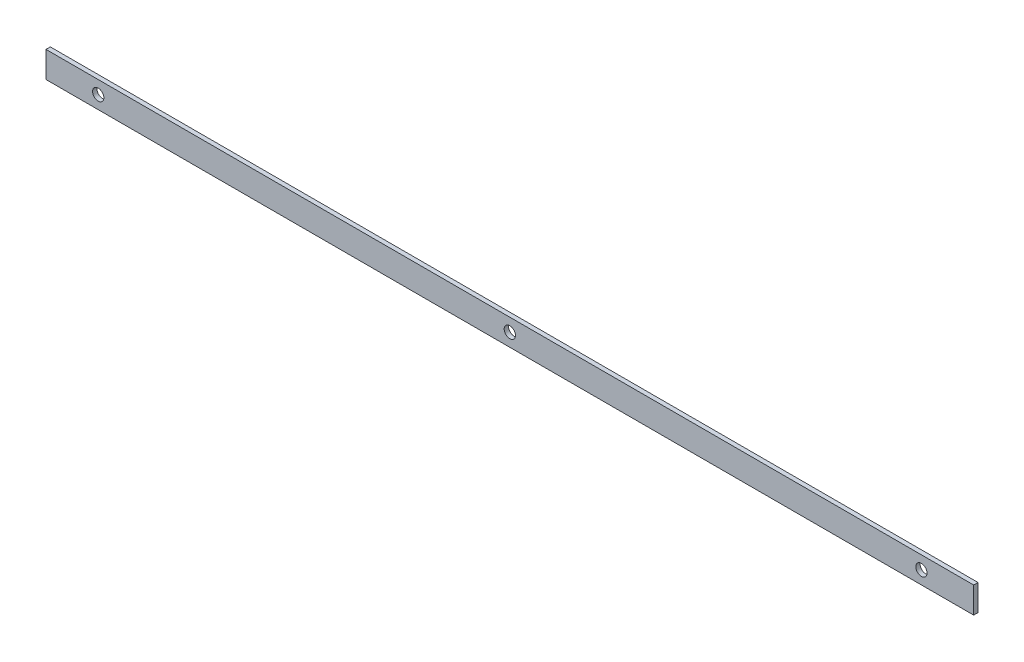
ISO-10303-21;
HEADER;
FILE_DESCRIPTION(('STEP AP214'),'2;1');
FILE_NAME('part.step','',(''),(''),'','','');
FILE_SCHEMA(('AUTOMOTIVE_DESIGN { 1 0 10303 214 1 1 1 1 }'));
ENDSEC;
DATA;
#1=APPLICATION_CONTEXT('core data for automotive mechanical design processes');
#2=APPLICATION_PROTOCOL_DEFINITION('international standard','automotive_design',2000,#1);
#3=PRODUCT_CONTEXT('',#1,'mechanical');
#4=PRODUCT('Part','Part','',(#3));
#5=PRODUCT_RELATED_PRODUCT_CATEGORY('part','',(#4));
#6=PRODUCT_DEFINITION_FORMATION('','',#4);
#7=PRODUCT_DEFINITION_CONTEXT('part definition',#1,'design');
#8=PRODUCT_DEFINITION('design','',#6,#7);
#9=PRODUCT_DEFINITION_SHAPE('','',#8);
#10=(LENGTH_UNIT() NAMED_UNIT(*) SI_UNIT(.MILLI.,.METRE.));
#11=(NAMED_UNIT(*) PLANE_ANGLE_UNIT() SI_UNIT($,.RADIAN.));
#12=(NAMED_UNIT(*) SI_UNIT($,.STERADIAN.) SOLID_ANGLE_UNIT());
#13=UNCERTAINTY_MEASURE_WITH_UNIT(LENGTH_MEASURE(1.E-05),#10,'distance_accuracy_value','');
#14=(GEOMETRIC_REPRESENTATION_CONTEXT(3) GLOBAL_UNCERTAINTY_ASSIGNED_CONTEXT((#13)) GLOBAL_UNIT_ASSIGNED_CONTEXT((#10,
#11,#12)) REPRESENTATION_CONTEXT('',''));
#15=CARTESIAN_POINT('',(0.,0.,0.));
#16=DIRECTION('',(0.,0.,1.));
#17=DIRECTION('',(1.,0.,0.));
#18=AXIS2_PLACEMENT_3D('',#15,#16,#17);
#19=CARTESIAN_POINT('',(473.,0.,-2.5));
#20=DIRECTION('',(0.,0.,-1.));
#21=DIRECTION('',(-1.,0.,0.));
#22=AXIS2_PLACEMENT_3D('',#19,#20,#21);
#23=CYLINDRICAL_SURFACE('',#22,6.50000000000001);
#24=CARTESIAN_POINT('',(473.,0.,2.5));
#25=DIRECTION('',(0.,0.,-1.));
#26=DIRECTION('',(-1.,0.,0.));
#27=AXIS2_PLACEMENT_3D('',#24,#25,#26);
#28=CIRCLE('',#27,6.50000000000001);
#29=CARTESIAN_POINT('',(466.5,0.,2.5));
#30=VERTEX_POINT('',#29);
#31=EDGE_CURVE('E57',#30,#30,#28,.T.);
#32=ORIENTED_EDGE('',*,*,#31,.F.);
#33=EDGE_LOOP('',(#32));
#34=FACE_BOUND('',#33,.T.);
#35=CARTESIAN_POINT('',(473.,0.,-2.5));
#36=DIRECTION('',(0.,0.,-1.));
#37=DIRECTION('',(-1.,0.,0.));
#38=AXIS2_PLACEMENT_3D('',#35,#36,#37);
#39=CIRCLE('',#38,6.50000000000001);
#40=CARTESIAN_POINT('',(466.5,0.,-2.5));
#41=VERTEX_POINT('',#40);
#42=EDGE_CURVE('E12',#41,#41,#39,.T.);
#43=ORIENTED_EDGE('',*,*,#42,.T.);
#44=EDGE_LOOP('',(#43));
#45=FACE_BOUND('',#44,.T.);
#46=ADVANCED_FACE('F49',(#34,#45),#23,.F.);
#47=CARTESIAN_POINT('',(533.,-15.,2.5));
#48=DIRECTION('',(0.,1.,0.));
#49=DIRECTION('',(0.,0.,1.));
#50=AXIS2_PLACEMENT_3D('',#47,#48,#49);
#51=PLANE('',#50);
#52=DIRECTION('',(0.,0.,-1.));
#53=VECTOR('',#52,1.);
#54=CARTESIAN_POINT('',(-533.,-15.,2.5));
#55=LINE('',#54,#53);
#56=CARTESIAN_POINT('',(-533.,-15.,2.5));
#57=VERTEX_POINT('',#56);
#58=CARTESIAN_POINT('',(-533.,-15.,-2.5));
#59=VERTEX_POINT('',#58);
#60=EDGE_CURVE('E117',#57,#59,#55,.T.);
#61=ORIENTED_EDGE('',*,*,#60,.T.);
#62=DIRECTION('',(-1.,0.,0.));
#63=VECTOR('',#62,1.);
#64=CARTESIAN_POINT('',(533.,-15.,-2.5));
#65=LINE('',#64,#63);
#66=CARTESIAN_POINT('',(533.,-15.,-2.5));
#67=VERTEX_POINT('',#66);
#68=EDGE_CURVE('E108',#67,#59,#65,.T.);
#69=ORIENTED_EDGE('',*,*,#68,.F.);
#70=DIRECTION('',(0.,0.,-1.));
#71=VECTOR('',#70,1.);
#72=CARTESIAN_POINT('',(533.,-15.,2.5));
#73=LINE('',#72,#71);
#74=CARTESIAN_POINT('',(533.,-15.,2.5));
#75=VERTEX_POINT('',#74);
#76=EDGE_CURVE('E101',#75,#67,#73,.T.);
#77=ORIENTED_EDGE('',*,*,#76,.F.);
#78=DIRECTION('',(-1.,0.,0.));
#79=VECTOR('',#78,1.);
#80=CARTESIAN_POINT('',(533.,-15.,2.5));
#81=LINE('',#80,#79);
#82=EDGE_CURVE('E113',#75,#57,#81,.T.);
#83=ORIENTED_EDGE('',*,*,#82,.T.);
#84=EDGE_LOOP('',(#61,#69,#77,#83));
#85=FACE_BOUND('',#84,.T.);
#86=ADVANCED_FACE('F133',(#85),#51,.F.);
#87=CARTESIAN_POINT('',(533.,-15.,-2.5));
#88=DIRECTION('',(0.,0.,1.));
#89=DIRECTION('',(1.,0.,0.));
#90=AXIS2_PLACEMENT_3D('',#87,#88,#89);
#91=PLANE('',#90);
#92=CARTESIAN_POINT('',(0.,0.,-2.5));
#93=DIRECTION('',(0.,0.,-1.));
#94=DIRECTION('',(-1.,0.,0.));
#95=AXIS2_PLACEMENT_3D('',#92,#93,#94);
#96=CIRCLE('',#95,6.50000000000001);
#97=CARTESIAN_POINT('',(-6.50000000000006,0.,-2.5));
#98=VERTEX_POINT('',#97);
#99=EDGE_CURVE('E170',#98,#98,#96,.T.);
#100=ORIENTED_EDGE('',*,*,#99,.F.);
#101=EDGE_LOOP('',(#100));
#102=FACE_BOUND('',#101,.T.);
#103=CARTESIAN_POINT('',(-473.,0.,-2.5));
#104=DIRECTION('',(0.,0.,-1.));
#105=DIRECTION('',(-1.,0.,0.));
#106=AXIS2_PLACEMENT_3D('',#103,#104,#105);
#107=CIRCLE('',#106,6.50000000000001);
#108=CARTESIAN_POINT('',(-479.5,0.,-2.5));
#109=VERTEX_POINT('',#108);
#110=EDGE_CURVE('E171',#109,#109,#107,.T.);
#111=ORIENTED_EDGE('',*,*,#110,.F.);
#112=EDGE_LOOP('',(#111));
#113=FACE_BOUND('',#112,.T.);
#114=DIRECTION('',(0.,1.,0.));
#115=VECTOR('',#114,1.);
#116=CARTESIAN_POINT('',(-533.,-15.,-2.5));
#117=LINE('',#116,#115);
#118=CARTESIAN_POINT('',(-533.,15.,-2.5));
#119=VERTEX_POINT('',#118);
#120=EDGE_CURVE('E107',#59,#119,#117,.T.);
#121=ORIENTED_EDGE('',*,*,#120,.T.);
#122=DIRECTION('',(-1.,0.,0.));
#123=VECTOR('',#122,1.);
#124=CARTESIAN_POINT('',(533.,15.,-2.5));
#125=LINE('',#124,#123);
#126=CARTESIAN_POINT('',(533.,15.,-2.5));
#127=VERTEX_POINT('',#126);
#128=EDGE_CURVE('E104',#127,#119,#125,.T.);
#129=ORIENTED_EDGE('',*,*,#128,.F.);
#130=DIRECTION('',(0.,1.,0.));
#131=VECTOR('',#130,1.);
#132=CARTESIAN_POINT('',(533.,-15.,-2.5));
#133=LINE('',#132,#131);
#134=EDGE_CURVE('E96',#67,#127,#133,.T.);
#135=ORIENTED_EDGE('',*,*,#134,.F.);
#136=ORIENTED_EDGE('',*,*,#68,.T.);
#137=EDGE_LOOP('',(#121,#129,#135,#136));
#138=FACE_BOUND('',#137,.T.);
#139=ORIENTED_EDGE('',*,*,#42,.F.);
#140=EDGE_LOOP('',(#139));
#141=FACE_BOUND('',#140,.T.);
#142=ADVANCED_FACE('F105',(#102,#113,#138,#141),#91,.F.);
#143=CARTESIAN_POINT('',(533.,15.,2.5));
#144=DIRECTION('',(0.,-1.,0.));
#145=DIRECTION('',(0.,0.,-1.));
#146=AXIS2_PLACEMENT_3D('',#143,#144,#145);
#147=PLANE('',#146);
#148=DIRECTION('',(0.,0.,1.));
#149=VECTOR('',#148,1.);
#150=CARTESIAN_POINT('',(-533.,15.,2.5));
#151=LINE('',#150,#149);
#152=CARTESIAN_POINT('',(-533.,15.,2.5));
#153=VERTEX_POINT('',#152);
#154=EDGE_CURVE('E82',#119,#153,#151,.T.);
#155=ORIENTED_EDGE('',*,*,#154,.T.);
#156=DIRECTION('',(-1.,0.,0.));
#157=VECTOR('',#156,1.);
#158=CARTESIAN_POINT('',(533.,15.,2.5));
#159=LINE('',#158,#157);
#160=CARTESIAN_POINT('',(533.,15.,2.5));
#161=VERTEX_POINT('',#160);
#162=EDGE_CURVE('E109',#161,#153,#159,.T.);
#163=ORIENTED_EDGE('',*,*,#162,.F.);
#164=DIRECTION('',(0.,0.,1.));
#165=VECTOR('',#164,1.);
#166=CARTESIAN_POINT('',(533.,15.,2.5));
#167=LINE('',#166,#165);
#168=EDGE_CURVE('E99',#127,#161,#167,.T.);
#169=ORIENTED_EDGE('',*,*,#168,.F.);
#170=ORIENTED_EDGE('',*,*,#128,.T.);
#171=EDGE_LOOP('',(#155,#163,#169,#170));
#172=FACE_BOUND('',#171,.T.);
#173=ADVANCED_FACE('F111',(#172),#147,.F.);
#174=CARTESIAN_POINT('',(533.,-15.,2.5));
#175=DIRECTION('',(0.,0.,-1.));
#176=DIRECTION('',(-1.,0.,0.));
#177=AXIS2_PLACEMENT_3D('',#174,#175,#176);
#178=PLANE('',#177);
#179=CARTESIAN_POINT('',(0.,0.,2.5));
#180=DIRECTION('',(0.,0.,-1.));
#181=DIRECTION('',(-1.,0.,0.));
#182=AXIS2_PLACEMENT_3D('',#179,#180,#181);
#183=CIRCLE('',#182,6.50000000000001);
#184=CARTESIAN_POINT('',(-6.50000000000006,0.,2.5));
#185=VERTEX_POINT('',#184);
#186=EDGE_CURVE('E168',#185,#185,#183,.T.);
#187=ORIENTED_EDGE('',*,*,#186,.T.);
#188=EDGE_LOOP('',(#187));
#189=FACE_BOUND('',#188,.T.);
#190=CARTESIAN_POINT('',(-473.,0.,2.5));
#191=DIRECTION('',(0.,0.,-1.));
#192=DIRECTION('',(-1.,0.,0.));
#193=AXIS2_PLACEMENT_3D('',#190,#191,#192);
#194=CIRCLE('',#193,6.50000000000001);
#195=CARTESIAN_POINT('',(-479.5,0.,2.5));
#196=VERTEX_POINT('',#195);
#197=EDGE_CURVE('E120',#196,#196,#194,.T.);
#198=ORIENTED_EDGE('',*,*,#197,.T.);
#199=EDGE_LOOP('',(#198));
#200=FACE_BOUND('',#199,.T.);
#201=DIRECTION('',(0.,-1.,0.));
#202=VECTOR('',#201,1.);
#203=CARTESIAN_POINT('',(-533.,-15.,2.5));
#204=LINE('',#203,#202);
#205=EDGE_CURVE('E88',#153,#57,#204,.T.);
#206=ORIENTED_EDGE('',*,*,#205,.T.);
#207=ORIENTED_EDGE('',*,*,#82,.F.);
#208=DIRECTION('',(0.,-1.,0.));
#209=VECTOR('',#208,1.);
#210=CARTESIAN_POINT('',(533.,-15.,2.5));
#211=LINE('',#210,#209);
#212=EDGE_CURVE('E65',#161,#75,#211,.T.);
#213=ORIENTED_EDGE('',*,*,#212,.F.);
#214=ORIENTED_EDGE('',*,*,#162,.T.);
#215=EDGE_LOOP('',(#206,#207,#213,#214));
#216=FACE_BOUND('',#215,.T.);
#217=ORIENTED_EDGE('',*,*,#31,.T.);
#218=EDGE_LOOP('',(#217));
#219=FACE_BOUND('',#218,.T.);
#220=ADVANCED_FACE('F129',(#189,#200,#216,#219),#178,.F.);
#221=CARTESIAN_POINT('',(533.,-15.,-2.5));
#222=DIRECTION('',(1.,0.,0.));
#223=DIRECTION('',(0.,0.,-1.));
#224=AXIS2_PLACEMENT_3D('',#221,#222,#223);
#225=PLANE('',#224);
#226=ORIENTED_EDGE('',*,*,#76,.T.);
#227=ORIENTED_EDGE('',*,*,#134,.T.);
#228=ORIENTED_EDGE('',*,*,#168,.T.);
#229=ORIENTED_EDGE('',*,*,#212,.T.);
#230=EDGE_LOOP('',(#226,#227,#228,#229));
#231=FACE_BOUND('',#230,.T.);
#232=ADVANCED_FACE('F97',(#231),#225,.T.);
#233=CARTESIAN_POINT('',(-533.,-15.,-2.5));
#234=DIRECTION('',(1.,0.,0.));
#235=DIRECTION('',(0.,0.,-1.));
#236=AXIS2_PLACEMENT_3D('',#233,#234,#235);
#237=PLANE('',#236);
#238=ORIENTED_EDGE('',*,*,#60,.F.);
#239=ORIENTED_EDGE('',*,*,#205,.F.);
#240=ORIENTED_EDGE('',*,*,#154,.F.);
#241=ORIENTED_EDGE('',*,*,#120,.F.);
#242=EDGE_LOOP('',(#238,#239,#240,#241));
#243=FACE_BOUND('',#242,.T.);
#244=ADVANCED_FACE('F150',(#243),#237,.F.);
#245=CARTESIAN_POINT('',(-473.,0.,-2.5));
#246=DIRECTION('',(0.,0.,-1.));
#247=DIRECTION('',(-1.,0.,0.));
#248=AXIS2_PLACEMENT_3D('',#245,#246,#247);
#249=CYLINDRICAL_SURFACE('',#248,6.50000000000001);
#250=ORIENTED_EDGE('',*,*,#197,.F.);
#251=EDGE_LOOP('',(#250));
#252=FACE_BOUND('',#251,.T.);
#253=ORIENTED_EDGE('',*,*,#110,.T.);
#254=EDGE_LOOP('',(#253));
#255=FACE_BOUND('',#254,.T.);
#256=ADVANCED_FACE('F153',(#252,#255),#249,.F.);
#257=CARTESIAN_POINT('',(0.,0.,-2.5));
#258=DIRECTION('',(0.,0.,-1.));
#259=DIRECTION('',(-1.,0.,0.));
#260=AXIS2_PLACEMENT_3D('',#257,#258,#259);
#261=CYLINDRICAL_SURFACE('',#260,6.50000000000001);
#262=ORIENTED_EDGE('',*,*,#186,.F.);
#263=EDGE_LOOP('',(#262));
#264=FACE_BOUND('',#263,.T.);
#265=ORIENTED_EDGE('',*,*,#99,.T.);
#266=EDGE_LOOP('',(#265));
#267=FACE_BOUND('',#266,.T.);
#268=ADVANCED_FACE('F159',(#264,#267),#261,.F.);
#269=CLOSED_SHELL('',(#46,#86,#142,#173,#220,#232,#244,#256,#268));
#270=MANIFOLD_SOLID_BREP('B2',#269);
#271=ADVANCED_BREP_SHAPE_REPRESENTATION('',(#18,#270),#14);
#272=SHAPE_DEFINITION_REPRESENTATION(#9,#271);
ENDSEC;
END-ISO-10303-21;
